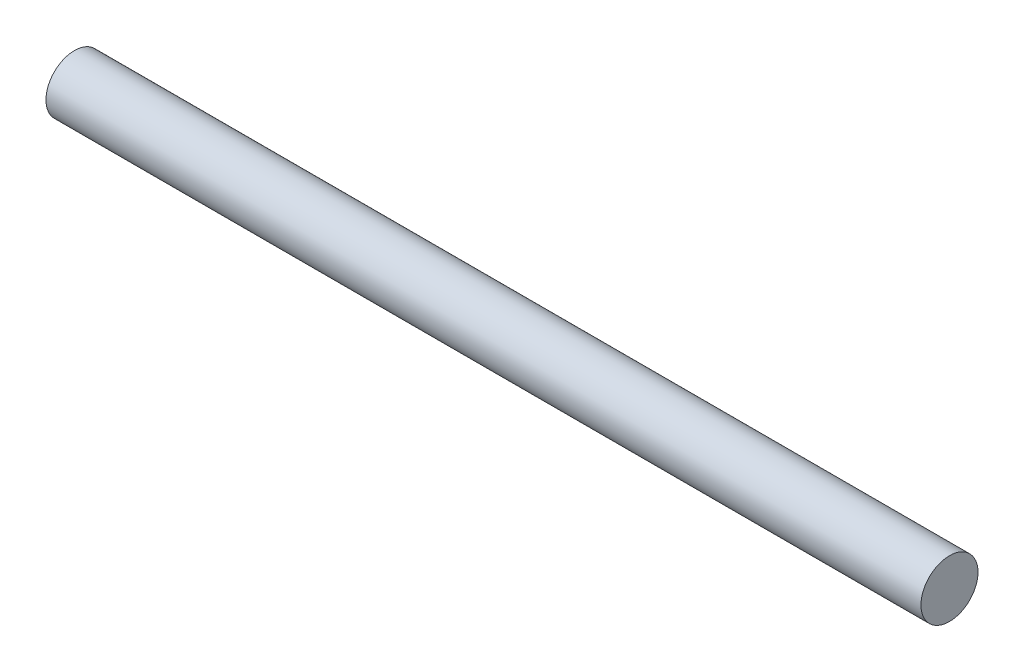
ISO-10303-21;
HEADER;
FILE_DESCRIPTION(('STEP AP214'),'2;1');
FILE_NAME('part.step','',(''),(''),'','','');
FILE_SCHEMA(('AUTOMOTIVE_DESIGN { 1 0 10303 214 1 1 1 1 }'));
ENDSEC;
DATA;
#1=APPLICATION_CONTEXT('core data for automotive mechanical design processes');
#2=APPLICATION_PROTOCOL_DEFINITION('international standard','automotive_design',2000,#1);
#3=PRODUCT_CONTEXT('',#1,'mechanical');
#4=PRODUCT('Part','Part','',(#3));
#5=PRODUCT_RELATED_PRODUCT_CATEGORY('part','',(#4));
#6=PRODUCT_DEFINITION_FORMATION('','',#4);
#7=PRODUCT_DEFINITION_CONTEXT('part definition',#1,'design');
#8=PRODUCT_DEFINITION('design','',#6,#7);
#9=PRODUCT_DEFINITION_SHAPE('','',#8);
#10=(LENGTH_UNIT() NAMED_UNIT(*) SI_UNIT(.MILLI.,.METRE.));
#11=(NAMED_UNIT(*) PLANE_ANGLE_UNIT() SI_UNIT($,.RADIAN.));
#12=(NAMED_UNIT(*) SI_UNIT($,.STERADIAN.) SOLID_ANGLE_UNIT());
#13=UNCERTAINTY_MEASURE_WITH_UNIT(LENGTH_MEASURE(1.E-05),#10,'distance_accuracy_value','');
#14=(GEOMETRIC_REPRESENTATION_CONTEXT(3) GLOBAL_UNCERTAINTY_ASSIGNED_CONTEXT((#13)) GLOBAL_UNIT_ASSIGNED_CONTEXT((#10,
#11,#12)) REPRESENTATION_CONTEXT('',''));
#15=CARTESIAN_POINT('',(0.,0.,0.));
#16=DIRECTION('',(0.,0.,1.));
#17=DIRECTION('',(1.,0.,0.));
#18=AXIS2_PLACEMENT_3D('',#15,#16,#17);
#19=CARTESIAN_POINT('',(70.104,0.,0.));
#20=DIRECTION('',(-1.,0.,0.));
#21=DIRECTION('',(0.,0.,1.));
#22=AXIS2_PLACEMENT_3D('',#19,#20,#21);
#23=CYLINDRICAL_SURFACE('',#22,2.286);
#24=CARTESIAN_POINT('',(70.104,0.,0.));
#25=DIRECTION('',(1.,0.,0.));
#26=DIRECTION('',(0.,0.,-1.));
#27=AXIS2_PLACEMENT_3D('',#24,#25,#26);
#28=CIRCLE('',#27,2.286);
#29=CARTESIAN_POINT('',(70.104,0.,-2.286));
#30=VERTEX_POINT('',#29);
#31=EDGE_CURVE('E10',#30,#30,#28,.T.);
#32=ORIENTED_EDGE('',*,*,#31,.F.);
#33=EDGE_LOOP('',(#32));
#34=FACE_BOUND('',#33,.T.);
#35=CARTESIAN_POINT('',(0.,0.,0.));
#36=DIRECTION('',(1.,0.,0.));
#37=DIRECTION('',(0.,0.,-1.));
#38=AXIS2_PLACEMENT_3D('',#35,#36,#37);
#39=CIRCLE('',#38,2.286);
#40=CARTESIAN_POINT('',(0.,0.,-2.286));
#41=VERTEX_POINT('',#40);
#42=EDGE_CURVE('E36',#41,#41,#39,.T.);
#43=ORIENTED_EDGE('',*,*,#42,.T.);
#44=EDGE_LOOP('',(#43));
#45=FACE_BOUND('',#44,.T.);
#46=ADVANCED_FACE('F33',(#34,#45),#23,.T.);
#47=CARTESIAN_POINT('',(70.104,0.,0.));
#48=DIRECTION('',(1.,0.,0.));
#49=DIRECTION('',(0.,0.,-1.));
#50=AXIS2_PLACEMENT_3D('',#47,#48,#49);
#51=PLANE('',#50);
#52=ORIENTED_EDGE('',*,*,#31,.T.);
#53=EDGE_LOOP('',(#52));
#54=FACE_BOUND('',#53,.T.);
#55=ADVANCED_FACE('F48',(#54),#51,.T.);
#56=CARTESIAN_POINT('',(0.,0.,0.));
#57=DIRECTION('',(1.,0.,0.));
#58=DIRECTION('',(0.,0.,-1.));
#59=AXIS2_PLACEMENT_3D('',#56,#57,#58);
#60=PLANE('',#59);
#61=ORIENTED_EDGE('',*,*,#42,.F.);
#62=EDGE_LOOP('',(#61));
#63=FACE_BOUND('',#62,.T.);
#64=ADVANCED_FACE('F46',(#63),#60,.F.);
#65=CLOSED_SHELL('',(#46,#55,#64));
#66=MANIFOLD_SOLID_BREP('B2',#65);
#67=ADVANCED_BREP_SHAPE_REPRESENTATION('',(#18,#66),#14);
#68=SHAPE_DEFINITION_REPRESENTATION(#9,#67);
ENDSEC;
END-ISO-10303-21;
